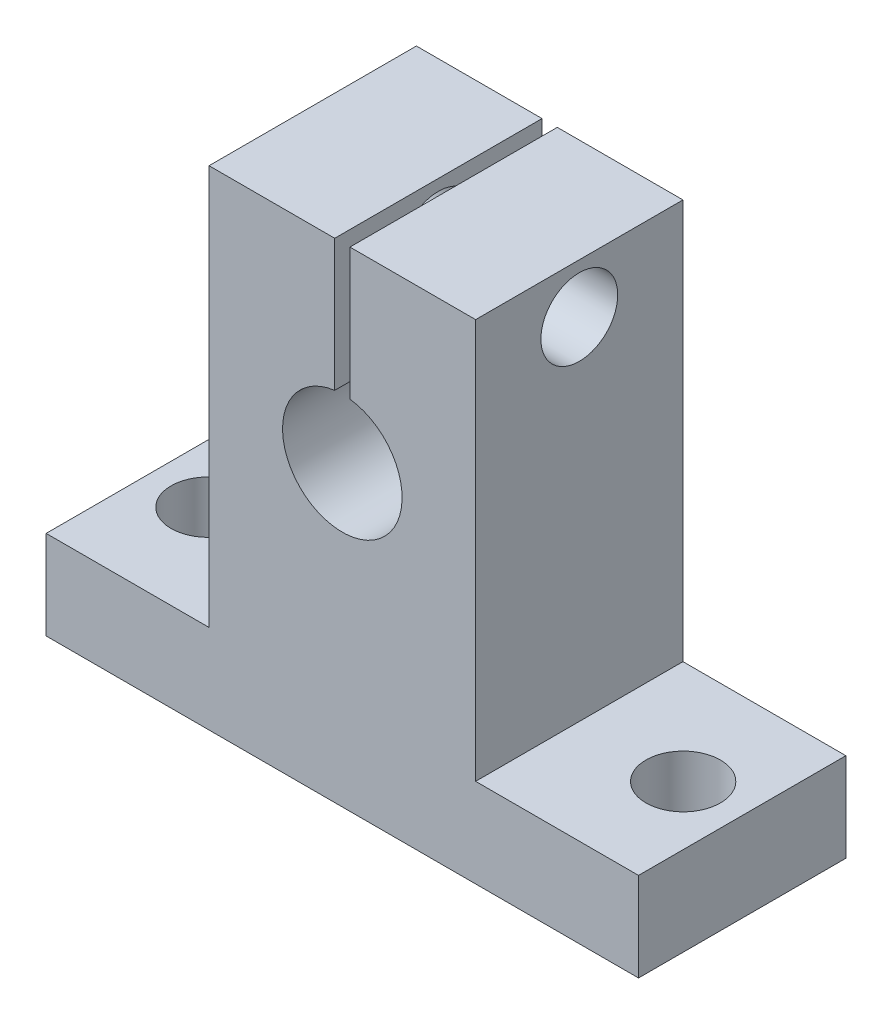
ISO-10303-21;
HEADER;
FILE_DESCRIPTION(('STEP AP214'),'2;1');
FILE_NAME('part.step','',(''),(''),'','','');
FILE_SCHEMA(('AUTOMOTIVE_DESIGN { 1 0 10303 214 1 1 1 1 }'));
ENDSEC;
DATA;
#1=APPLICATION_CONTEXT('core data for automotive mechanical design processes');
#2=APPLICATION_PROTOCOL_DEFINITION('international standard','automotive_design',2000,#1);
#3=PRODUCT_CONTEXT('',#1,'mechanical');
#4=PRODUCT('Part','Part','',(#3));
#5=PRODUCT_RELATED_PRODUCT_CATEGORY('part','',(#4));
#6=PRODUCT_DEFINITION_FORMATION('','',#4);
#7=PRODUCT_DEFINITION_CONTEXT('part definition',#1,'design');
#8=PRODUCT_DEFINITION('design','',#6,#7);
#9=PRODUCT_DEFINITION_SHAPE('','',#8);
#10=(LENGTH_UNIT() NAMED_UNIT(*) SI_UNIT(.MILLI.,.METRE.));
#11=(NAMED_UNIT(*) PLANE_ANGLE_UNIT() SI_UNIT($,.RADIAN.));
#12=(NAMED_UNIT(*) SI_UNIT($,.STERADIAN.) SOLID_ANGLE_UNIT());
#13=UNCERTAINTY_MEASURE_WITH_UNIT(LENGTH_MEASURE(1.E-05),#10,'distance_accuracy_value','');
#14=(GEOMETRIC_REPRESENTATION_CONTEXT(3) GLOBAL_UNCERTAINTY_ASSIGNED_CONTEXT((#13)) GLOBAL_UNIT_ASSIGNED_CONTEXT((#10,
#11,#12)) REPRESENTATION_CONTEXT('',''));
#15=CARTESIAN_POINT('',(0.,0.,0.));
#16=DIRECTION('',(0.,0.,1.));
#17=DIRECTION('',(1.,0.,0.));
#18=AXIS2_PLACEMENT_3D('',#15,#16,#17);
#19=CARTESIAN_POINT('',(-2.00038617608939,17.6991691104593,14.0000000000002));
#20=DIRECTION('',(0.,1.,0.));
#21=DIRECTION('',(0.,0.,1.));
#22=AXIS2_PLACEMENT_3D('',#19,#20,#21);
#23=PLANE('',#22);
#24=DIRECTION('',(0.,0.,-1.));
#25=VECTOR('',#24,1.);
#26=CARTESIAN_POINT('',(7.51407649357956,17.6991691104593,14.0000000000002));
#27=LINE('',#26,#25);
#28=CARTESIAN_POINT('',(7.51407649357956,17.6991691104593,14.0000000000002));
#29=VERTEX_POINT('',#28);
#30=CARTESIAN_POINT('',(7.51407649357935,17.6991691104593,0.));
#31=VERTEX_POINT('',#30);
#32=EDGE_CURVE('E221',#29,#31,#27,.T.);
#33=ORIENTED_EDGE('',*,*,#32,.F.);
#34=DIRECTION('',(1.,0.,0.));
#35=VECTOR('',#34,1.);
#36=CARTESIAN_POINT('',(-2.00038617608939,17.6991691104593,14.0000000000002));
#37=LINE('',#36,#35);
#38=CARTESIAN_POINT('',(15.9996138239114,17.6991691104593,14.0000000000002));
#39=VERTEX_POINT('',#38);
#40=EDGE_CURVE('E137',#29,#39,#37,.T.);
#41=ORIENTED_EDGE('',*,*,#40,.T.);
#42=DIRECTION('',(0.,0.,-1.));
#43=VECTOR('',#42,1.);
#44=CARTESIAN_POINT('',(15.9996138239114,17.6991691104593,14.0000000000002));
#45=LINE('',#44,#43);
#46=CARTESIAN_POINT('',(15.9996138239105,17.6991691104593,0.));
#47=VERTEX_POINT('',#46);
#48=EDGE_CURVE('E203',#39,#47,#45,.T.);
#49=ORIENTED_EDGE('',*,*,#48,.T.);
#50=DIRECTION('',(1.,0.,0.));
#51=VECTOR('',#50,1.);
#52=CARTESIAN_POINT('',(-2.0003861760894,17.6991691104593,0.));
#53=LINE('',#52,#51);
#54=EDGE_CURVE('E181',#31,#47,#53,.T.);
#55=ORIENTED_EDGE('',*,*,#54,.F.);
#56=EDGE_LOOP('',(#33,#41,#49,#55));
#57=FACE_BOUND('',#56,.T.);
#58=ADVANCED_FACE('F37',(#57),#23,.T.);
#59=CARTESIAN_POINT('',(26.9996138239105,-15.3008308895406,14.0000000000002));
#60=DIRECTION('',(-1.,0.,0.));
#61=DIRECTION('',(0.,0.,1.));
#62=AXIS2_PLACEMENT_3D('',#59,#60,#61);
#63=PLANE('',#62);
#64=DIRECTION('',(0.,1.,0.));
#65=VECTOR('',#64,1.);
#66=CARTESIAN_POINT('',(26.9996138239109,-15.3008308895406,0.));
#67=LINE('',#66,#65);
#68=CARTESIAN_POINT('',(26.9996138239109,-15.3008308895406,0.));
#69=VERTEX_POINT('',#68);
#70=CARTESIAN_POINT('',(26.9996138239113,-9.30083088954037,0.));
#71=VERTEX_POINT('',#70);
#72=EDGE_CURVE('E144',#69,#71,#67,.T.);
#73=ORIENTED_EDGE('',*,*,#72,.T.);
#74=DIRECTION('',(0.,0.,-1.));
#75=VECTOR('',#74,1.);
#76=CARTESIAN_POINT('',(26.9996138239113,-9.30083088954037,14.0000000000002));
#77=LINE('',#76,#75);
#78=CARTESIAN_POINT('',(26.9996138239113,-9.30083088954037,14.0000000000002));
#79=VERTEX_POINT('',#78);
#80=EDGE_CURVE('E208',#79,#71,#77,.T.);
#81=ORIENTED_EDGE('',*,*,#80,.F.);
#82=DIRECTION('',(0.,1.,0.));
#83=VECTOR('',#82,1.);
#84=CARTESIAN_POINT('',(26.9996138239105,-15.3008308895406,14.0000000000002));
#85=LINE('',#84,#83);
#86=CARTESIAN_POINT('',(26.9996138239105,-15.3008308895406,14.0000000000002));
#87=VERTEX_POINT('',#86);
#88=EDGE_CURVE('E153',#87,#79,#85,.T.);
#89=ORIENTED_EDGE('',*,*,#88,.F.);
#90=DIRECTION('',(0.,0.,-1.));
#91=VECTOR('',#90,1.);
#92=CARTESIAN_POINT('',(26.9996138239105,-15.3008308895406,14.0000000000002));
#93=LINE('',#92,#91);
#94=EDGE_CURVE('E210',#87,#69,#93,.T.);
#95=ORIENTED_EDGE('',*,*,#94,.T.);
#96=EDGE_LOOP('',(#73,#81,#89,#95));
#97=FACE_BOUND('',#96,.T.);
#98=ADVANCED_FACE('F39',(#97),#63,.F.);
#99=CARTESIAN_POINT('',(15.9996138239111,-9.30083088954037,14.0000000000002));
#100=DIRECTION('',(0.,1.,0.));
#101=DIRECTION('',(0.,0.,1.));
#102=AXIS2_PLACEMENT_3D('',#99,#100,#101);
#103=PLANE('',#102);
#104=CARTESIAN_POINT('',(23.0145157220571,-9.30083088954037,6.99999999999967));
#105=DIRECTION('',(0.,1.,0.));
#106=DIRECTION('',(0.,0.,1.));
#107=AXIS2_PLACEMENT_3D('',#104,#105,#106);
#108=CIRCLE('',#107,2.51486763293019);
#109=CARTESIAN_POINT('',(23.0145157220571,-9.30083088954034,9.51486763292987));
#110=VERTEX_POINT('',#109);
#111=EDGE_CURVE('E216',#110,#110,#108,.T.);
#112=ORIENTED_EDGE('',*,*,#111,.F.);
#113=EDGE_LOOP('',(#112));
#114=FACE_BOUND('',#113,.T.);
#115=DIRECTION('',(1.,0.,0.));
#116=VECTOR('',#115,1.);
#117=CARTESIAN_POINT('',(15.9996138239106,-9.30083088954037,0.));
#118=LINE('',#117,#116);
#119=CARTESIAN_POINT('',(15.9996138239106,-9.30083088954037,0.));
#120=VERTEX_POINT('',#119);
#121=EDGE_CURVE('E175',#120,#71,#118,.T.);
#122=ORIENTED_EDGE('',*,*,#121,.F.);
#123=DIRECTION('',(0.,0.,-1.));
#124=VECTOR('',#123,1.);
#125=CARTESIAN_POINT('',(15.9996138239111,-9.30083088954037,14.0000000000002));
#126=LINE('',#125,#124);
#127=CARTESIAN_POINT('',(15.9996138239111,-9.30083088954037,14.0000000000002));
#128=VERTEX_POINT('',#127);
#129=EDGE_CURVE('E206',#128,#120,#126,.T.);
#130=ORIENTED_EDGE('',*,*,#129,.F.);
#131=DIRECTION('',(1.,0.,0.));
#132=VECTOR('',#131,1.);
#133=CARTESIAN_POINT('',(15.9996138239111,-9.30083088954037,14.0000000000002));
#134=LINE('',#133,#132);
#135=EDGE_CURVE('E156',#128,#79,#134,.T.);
#136=ORIENTED_EDGE('',*,*,#135,.T.);
#137=ORIENTED_EDGE('',*,*,#80,.T.);
#138=EDGE_LOOP('',(#122,#130,#136,#137));
#139=FACE_BOUND('',#138,.T.);
#140=ADVANCED_FACE('F266',(#114,#139),#103,.T.);
#141=CARTESIAN_POINT('',(15.9996138239114,17.6991691104593,14.0000000000002));
#142=DIRECTION('',(1.,0.,0.));
#143=DIRECTION('',(0.,1.,0.));
#144=AXIS2_PLACEMENT_3D('',#141,#142,#143);
#145=PLANE('',#144);
#146=CARTESIAN_POINT('',(15.9996138239107,14.3512632276526,6.99999999999967));
#147=DIRECTION('',(1.,0.,0.));
#148=DIRECTION('',(0.,1.,0.));
#149=AXIS2_PLACEMENT_3D('',#146,#147,#148);
#150=CIRCLE('',#149,2.5939753446912);
#151=CARTESIAN_POINT('',(15.9996138239107,16.9452385723438,6.9999999999997));
#152=VERTEX_POINT('',#151);
#153=EDGE_CURVE('E138',#152,#152,#150,.T.);
#154=ORIENTED_EDGE('',*,*,#153,.F.);
#155=EDGE_LOOP('',(#154));
#156=FACE_BOUND('',#155,.T.);
#157=DIRECTION('',(0.,-1.,0.));
#158=VECTOR('',#157,1.);
#159=CARTESIAN_POINT('',(15.9996138239105,17.6991691104593,0.));
#160=LINE('',#159,#158);
#161=EDGE_CURVE('E178',#47,#120,#160,.T.);
#162=ORIENTED_EDGE('',*,*,#161,.F.);
#163=ORIENTED_EDGE('',*,*,#48,.F.);
#164=DIRECTION('',(0.,-1.,0.));
#165=VECTOR('',#164,1.);
#166=CARTESIAN_POINT('',(15.9996138239114,17.6991691104593,14.0000000000002));
#167=LINE('',#166,#165);
#168=EDGE_CURVE('E159',#39,#128,#167,.T.);
#169=ORIENTED_EDGE('',*,*,#168,.T.);
#170=ORIENTED_EDGE('',*,*,#129,.T.);
#171=EDGE_LOOP('',(#162,#163,#169,#170));
#172=FACE_BOUND('',#171,.T.);
#173=ADVANCED_FACE('F272',(#156,#172),#145,.T.);
#174=DIRECTION('',(0.,0.,1.));
#175=VECTOR('',#174,1.);
#176=CARTESIAN_POINT('',(6.48515115424205,17.6991691104593,14.0000000000002));
#177=LINE('',#176,#175);
#178=CARTESIAN_POINT('',(6.48515115424203,17.6991691104593,0.));
#179=VERTEX_POINT('',#178);
#180=CARTESIAN_POINT('',(6.48515115424205,17.6991691104593,14.0000000000002));
#181=VERTEX_POINT('',#180);
#182=EDGE_CURVE('E225',#179,#181,#177,.T.);
#183=ORIENTED_EDGE('',*,*,#182,.F.);
#184=CARTESIAN_POINT('',(-2.0003861760894,17.6991691104593,0.));
#185=VERTEX_POINT('',#184);
#186=EDGE_CURVE('E182',#185,#179,#53,.T.);
#187=ORIENTED_EDGE('',*,*,#186,.F.);
#188=DIRECTION('',(0.,0.,-1.));
#189=VECTOR('',#188,1.);
#190=CARTESIAN_POINT('',(-2.00038617608939,17.6991691104593,14.0000000000002));
#191=LINE('',#190,#189);
#192=CARTESIAN_POINT('',(-2.00038617608939,17.6991691104593,14.0000000000002));
#193=VERTEX_POINT('',#192);
#194=EDGE_CURVE('E201',#193,#185,#191,.T.);
#195=ORIENTED_EDGE('',*,*,#194,.F.);
#196=EDGE_CURVE('E162',#193,#181,#37,.T.);
#197=ORIENTED_EDGE('',*,*,#196,.T.);
#198=EDGE_LOOP('',(#183,#187,#195,#197));
#199=FACE_BOUND('',#198,.T.);
#200=ADVANCED_FACE('F262',(#199),#23,.T.);
#201=CARTESIAN_POINT('',(-2.00038617608939,17.6991691104593,14.0000000000002));
#202=DIRECTION('',(1.,0.,0.));
#203=DIRECTION('',(0.,1.,0.));
#204=AXIS2_PLACEMENT_3D('',#201,#202,#203);
#205=PLANE('',#204);
#206=CARTESIAN_POINT('',(-2.00038617608947,14.3512632276526,6.99999999999967));
#207=DIRECTION('',(-1.,0.,0.));
#208=DIRECTION('',(0.,-1.,0.));
#209=AXIS2_PLACEMENT_3D('',#206,#207,#208);
#210=CIRCLE('',#209,2.5939753446912);
#211=CARTESIAN_POINT('',(-2.00038617608948,11.7572878829614,6.99999999999965));
#212=VERTEX_POINT('',#211);
#213=EDGE_CURVE('E239',#212,#212,#210,.T.);
#214=ORIENTED_EDGE('',*,*,#213,.F.);
#215=EDGE_LOOP('',(#214));
#216=FACE_BOUND('',#215,.T.);
#217=DIRECTION('',(0.,-1.,0.));
#218=VECTOR('',#217,1.);
#219=CARTESIAN_POINT('',(-2.0003861760894,17.6991691104593,0.));
#220=LINE('',#219,#218);
#221=CARTESIAN_POINT('',(-2.00038617608943,-9.30083088954037,0.));
#222=VERTEX_POINT('',#221);
#223=EDGE_CURVE('E185',#185,#222,#220,.T.);
#224=ORIENTED_EDGE('',*,*,#223,.T.);
#225=DIRECTION('',(0.,0.,-1.));
#226=VECTOR('',#225,1.);
#227=CARTESIAN_POINT('',(-2.00038617608939,-9.30083088954037,14.0000000000002));
#228=LINE('',#227,#226);
#229=CARTESIAN_POINT('',(-2.00038617608939,-9.30083088954037,14.0000000000002));
#230=VERTEX_POINT('',#229);
#231=EDGE_CURVE('E198',#230,#222,#228,.T.);
#232=ORIENTED_EDGE('',*,*,#231,.F.);
#233=DIRECTION('',(0.,-1.,0.));
#234=VECTOR('',#233,1.);
#235=CARTESIAN_POINT('',(-2.00038617608939,17.6991691104593,14.0000000000002));
#236=LINE('',#235,#234);
#237=EDGE_CURVE('E165',#193,#230,#236,.T.);
#238=ORIENTED_EDGE('',*,*,#237,.F.);
#239=ORIENTED_EDGE('',*,*,#194,.T.);
#240=EDGE_LOOP('',(#224,#232,#238,#239));
#241=FACE_BOUND('',#240,.T.);
#242=ADVANCED_FACE('F271',(#216,#241),#205,.F.);
#243=CARTESIAN_POINT('',(-2.00038617608939,-9.30083088954037,14.0000000000002));
#244=DIRECTION('',(0.,-1.,0.));
#245=DIRECTION('',(0.,0.,-1.));
#246=AXIS2_PLACEMENT_3D('',#243,#244,#245);
#247=PLANE('',#246);
#248=CARTESIAN_POINT('',(-9.06576440971987,-9.30083088954037,6.99999999999967));
#249=DIRECTION('',(0.,1.,0.));
#250=DIRECTION('',(0.,0.,1.));
#251=AXIS2_PLACEMENT_3D('',#248,#249,#250);
#252=CIRCLE('',#251,2.49774965335652);
#253=CARTESIAN_POINT('',(-9.06576440971988,-9.30083088954034,9.49774965335619));
#254=VERTEX_POINT('',#253);
#255=EDGE_CURVE('E147',#254,#254,#252,.T.);
#256=ORIENTED_EDGE('',*,*,#255,.F.);
#257=EDGE_LOOP('',(#256));
#258=FACE_BOUND('',#257,.T.);
#259=DIRECTION('',(-1.,0.,0.));
#260=VECTOR('',#259,1.);
#261=CARTESIAN_POINT('',(-2.00038617608943,-9.30083088954037,0.));
#262=LINE('',#261,#260);
#263=CARTESIAN_POINT('',(-13.0003861760891,-9.30083088954037,0.));
#264=VERTEX_POINT('',#263);
#265=EDGE_CURVE('E187',#222,#264,#262,.T.);
#266=ORIENTED_EDGE('',*,*,#265,.T.);
#267=DIRECTION('',(0.,0.,-1.));
#268=VECTOR('',#267,1.);
#269=CARTESIAN_POINT('',(-13.0003861760893,-9.30083088954037,14.0000000000002));
#270=LINE('',#269,#268);
#271=CARTESIAN_POINT('',(-13.0003861760893,-9.30083088954037,14.0000000000002));
#272=VERTEX_POINT('',#271);
#273=EDGE_CURVE('E196',#272,#264,#270,.T.);
#274=ORIENTED_EDGE('',*,*,#273,.F.);
#275=DIRECTION('',(-1.,0.,0.));
#276=VECTOR('',#275,1.);
#277=CARTESIAN_POINT('',(-2.00038617608939,-9.30083088954037,14.0000000000002));
#278=LINE('',#277,#276);
#279=EDGE_CURVE('E167',#230,#272,#278,.T.);
#280=ORIENTED_EDGE('',*,*,#279,.F.);
#281=ORIENTED_EDGE('',*,*,#231,.T.);
#282=EDGE_LOOP('',(#266,#274,#280,#281));
#283=FACE_BOUND('',#282,.T.);
#284=ADVANCED_FACE('F278',(#258,#283),#247,.F.);
#285=CARTESIAN_POINT('',(-13.0003861760896,-15.3008308895406,14.0000000000002));
#286=DIRECTION('',(-1.,0.,0.));
#287=DIRECTION('',(0.,0.,1.));
#288=AXIS2_PLACEMENT_3D('',#285,#286,#287);
#289=PLANE('',#288);
#290=DIRECTION('',(0.,1.,0.));
#291=VECTOR('',#290,1.);
#292=CARTESIAN_POINT('',(-13.0003861760888,-15.3008308895406,0.));
#293=LINE('',#292,#291);
#294=CARTESIAN_POINT('',(-13.0003861760888,-15.3008308895406,0.));
#295=VERTEX_POINT('',#294);
#296=EDGE_CURVE('E190',#295,#264,#293,.T.);
#297=ORIENTED_EDGE('',*,*,#296,.F.);
#298=DIRECTION('',(0.,0.,-1.));
#299=VECTOR('',#298,1.);
#300=CARTESIAN_POINT('',(-13.0003861760896,-15.3008308895406,14.0000000000002));
#301=LINE('',#300,#299);
#302=CARTESIAN_POINT('',(-13.0003861760896,-15.3008308895406,14.0000000000002));
#303=VERTEX_POINT('',#302);
#304=EDGE_CURVE('E172',#303,#295,#301,.T.);
#305=ORIENTED_EDGE('',*,*,#304,.F.);
#306=DIRECTION('',(0.,1.,0.));
#307=VECTOR('',#306,1.);
#308=CARTESIAN_POINT('',(-13.0003861760896,-15.3008308895406,14.0000000000002));
#309=LINE('',#308,#307);
#310=EDGE_CURVE('E169',#303,#272,#309,.T.);
#311=ORIENTED_EDGE('',*,*,#310,.T.);
#312=ORIENTED_EDGE('',*,*,#273,.T.);
#313=EDGE_LOOP('',(#297,#305,#311,#312));
#314=FACE_BOUND('',#313,.T.);
#315=ADVANCED_FACE('F299',(#314),#289,.T.);
#316=CARTESIAN_POINT('',(-2.00038617608944,-15.3008308895406,14.0000000000002));
#317=DIRECTION('',(0.,-1.,0.));
#318=DIRECTION('',(1.,0.,0.));
#319=AXIS2_PLACEMENT_3D('',#316,#317,#318);
#320=PLANE('',#319);
#321=CARTESIAN_POINT('',(23.0145157220567,-15.3008308895406,6.99999999999967));
#322=DIRECTION('',(0.,-1.,0.));
#323=DIRECTION('',(1.,0.,0.));
#324=AXIS2_PLACEMENT_3D('',#321,#322,#323);
#325=CIRCLE('',#324,2.51486763293019);
#326=CARTESIAN_POINT('',(25.5293833549869,-15.3008308895406,6.99999999999967));
#327=VERTEX_POINT('',#326);
#328=EDGE_CURVE('E213',#327,#327,#325,.T.);
#329=ORIENTED_EDGE('',*,*,#328,.F.);
#330=EDGE_LOOP('',(#329));
#331=FACE_BOUND('',#330,.T.);
#332=CARTESIAN_POINT('',(-9.06576440971973,-15.3008308895406,6.99999999999967));
#333=DIRECTION('',(0.,-1.,0.));
#334=DIRECTION('',(1.,0.,0.));
#335=AXIS2_PLACEMENT_3D('',#332,#333,#334);
#336=CIRCLE('',#335,2.49774965335652);
#337=CARTESIAN_POINT('',(-6.56801475636322,-15.3008308895406,6.99999999999967));
#338=VERTEX_POINT('',#337);
#339=EDGE_CURVE('E142',#338,#338,#336,.T.);
#340=ORIENTED_EDGE('',*,*,#339,.F.);
#341=EDGE_LOOP('',(#340));
#342=FACE_BOUND('',#341,.T.);
#343=DIRECTION('',(-1.,0.,0.));
#344=VECTOR('',#343,1.);
#345=CARTESIAN_POINT('',(-2.00038617608922,-15.3008308895406,0.));
#346=LINE('',#345,#344);
#347=EDGE_CURVE('E154',#69,#295,#346,.T.);
#348=ORIENTED_EDGE('',*,*,#347,.F.);
#349=ORIENTED_EDGE('',*,*,#94,.F.);
#350=DIRECTION('',(1.,0.,0.));
#351=VECTOR('',#350,1.);
#352=CARTESIAN_POINT('',(-2.00038617608944,-15.3008308895406,14.0000000000002));
#353=LINE('',#352,#351);
#354=EDGE_CURVE('E151',#303,#87,#353,.T.);
#355=ORIENTED_EDGE('',*,*,#354,.F.);
#356=ORIENTED_EDGE('',*,*,#304,.T.);
#357=EDGE_LOOP('',(#348,#349,#355,#356));
#358=FACE_BOUND('',#357,.T.);
#359=ADVANCED_FACE('F301',(#331,#342,#358),#320,.T.);
#360=CARTESIAN_POINT('',(1.75207071073658E-13,0.,14.0000000000002));
#361=DIRECTION('',(0.,0.,1.));
#362=DIRECTION('',(1.,0.,0.));
#363=AXIS2_PLACEMENT_3D('',#360,#361,#362);
#364=PLANE('',#363);
#365=DIRECTION('',(0.,1.,0.));
#366=VECTOR('',#365,1.);
#367=CARTESIAN_POINT('',(7.51407649357922,18.6554074490735,14.0000000000002));
#368=LINE('',#367,#366);
#369=CARTESIAN_POINT('',(7.51407649357929,8.80582091431048,14.0000000000002));
#370=VERTEX_POINT('',#369);
#371=EDGE_CURVE('E125',#370,#29,#368,.T.);
#372=ORIENTED_EDGE('',*,*,#371,.F.);
#373=CARTESIAN_POINT('',(6.99961382391089,4.80309765097786,14.0000000000002));
#374=DIRECTION('',(0.,0.,1.));
#375=DIRECTION('',(1.,0.,0.));
#376=AXIS2_PLACEMENT_3D('',#373,#374,#375);
#377=CIRCLE('',#376,4.03564931099154);
#378=CARTESIAN_POINT('',(6.48515115424222,8.80582091431048,14.0000000000002));
#379=VERTEX_POINT('',#378);
#380=EDGE_CURVE('E135',#379,#370,#377,.T.);
#381=ORIENTED_EDGE('',*,*,#380,.F.);
#382=DIRECTION('',(0.,-1.,0.));
#383=VECTOR('',#382,1.);
#384=CARTESIAN_POINT('',(6.48515115424237,18.6554074490735,14.0000000000002));
#385=LINE('',#384,#383);
#386=EDGE_CURVE('E53',#181,#379,#385,.T.);
#387=ORIENTED_EDGE('',*,*,#386,.F.);
#388=ORIENTED_EDGE('',*,*,#196,.F.);
#389=ORIENTED_EDGE('',*,*,#237,.T.);
#390=ORIENTED_EDGE('',*,*,#279,.T.);
#391=ORIENTED_EDGE('',*,*,#310,.F.);
#392=ORIENTED_EDGE('',*,*,#354,.T.);
#393=ORIENTED_EDGE('',*,*,#88,.T.);
#394=ORIENTED_EDGE('',*,*,#135,.F.);
#395=ORIENTED_EDGE('',*,*,#168,.F.);
#396=ORIENTED_EDGE('',*,*,#40,.F.);
#397=EDGE_LOOP('',(#372,#381,#387,#388,#389,#390,#391,#392,#393,#394,#395,#396));
#398=FACE_BOUND('',#397,.T.);
#399=ADVANCED_FACE('F134',(#398),#364,.T.);
#400=CARTESIAN_POINT('',(0.,0.,0.));
#401=DIRECTION('',(0.,0.,1.));
#402=DIRECTION('',(1.,0.,0.));
#403=AXIS2_PLACEMENT_3D('',#400,#401,#402);
#404=PLANE('',#403);
#405=CARTESIAN_POINT('',(6.99961382391046,4.80309765097786,0.));
#406=DIRECTION('',(0.,0.,1.));
#407=DIRECTION('',(1.,0.,0.));
#408=AXIS2_PLACEMENT_3D('',#405,#406,#407);
#409=CIRCLE('',#408,4.03564931099154);
#410=CARTESIAN_POINT('',(6.48515115424219,8.80582091431048,0.));
#411=VERTEX_POINT('',#410);
#412=CARTESIAN_POINT('',(7.51407649357923,8.80582091431048,0.));
#413=VERTEX_POINT('',#412);
#414=EDGE_CURVE('E141',#411,#413,#409,.T.);
#415=ORIENTED_EDGE('',*,*,#414,.T.);
#416=DIRECTION('',(0.,1.,0.));
#417=VECTOR('',#416,1.);
#418=CARTESIAN_POINT('',(7.51407649357909,18.6554074490735,0.));
#419=LINE('',#418,#417);
#420=EDGE_CURVE('E61',#413,#31,#419,.T.);
#421=ORIENTED_EDGE('',*,*,#420,.T.);
#422=ORIENTED_EDGE('',*,*,#54,.T.);
#423=ORIENTED_EDGE('',*,*,#161,.T.);
#424=ORIENTED_EDGE('',*,*,#121,.T.);
#425=ORIENTED_EDGE('',*,*,#72,.F.);
#426=ORIENTED_EDGE('',*,*,#347,.T.);
#427=ORIENTED_EDGE('',*,*,#296,.T.);
#428=ORIENTED_EDGE('',*,*,#265,.F.);
#429=ORIENTED_EDGE('',*,*,#223,.F.);
#430=ORIENTED_EDGE('',*,*,#186,.T.);
#431=DIRECTION('',(0.,-1.,0.));
#432=VECTOR('',#431,1.);
#433=CARTESIAN_POINT('',(6.48515115424203,18.6554074490735,0.));
#434=LINE('',#433,#432);
#435=EDGE_CURVE('E229',#179,#411,#434,.T.);
#436=ORIENTED_EDGE('',*,*,#435,.T.);
#437=EDGE_LOOP('',(#415,#421,#422,#423,#424,#425,#426,#427,#428,#429,#430,#436));
#438=FACE_BOUND('',#437,.T.);
#439=ADVANCED_FACE('F286',(#438),#404,.F.);
#440=CARTESIAN_POINT('',(6.99961382391046,4.80309765097786,0.));
#441=DIRECTION('',(0.,0.,1.));
#442=DIRECTION('',(1.,0.,0.));
#443=AXIS2_PLACEMENT_3D('',#440,#441,#442);
#444=CYLINDRICAL_SURFACE('',#443,4.03564931099154);
#445=ORIENTED_EDGE('',*,*,#380,.T.);
#446=DIRECTION('',(0.,0.,1.));
#447=VECTOR('',#446,1.);
#448=CARTESIAN_POINT('',(7.51407649357923,8.80582091431048,0.));
#449=LINE('',#448,#447);
#450=EDGE_CURVE('E11',#370,#413,#449,.F.);
#451=ORIENTED_EDGE('',*,*,#450,.T.);
#452=ORIENTED_EDGE('',*,*,#414,.F.);
#453=DIRECTION('',(0.,0.,1.));
#454=VECTOR('',#453,1.);
#455=CARTESIAN_POINT('',(6.48515115424219,8.80582091431048,0.));
#456=LINE('',#455,#454);
#457=EDGE_CURVE('E46',#411,#379,#456,.T.);
#458=ORIENTED_EDGE('',*,*,#457,.T.);
#459=EDGE_LOOP('',(#445,#451,#452,#458));
#460=FACE_BOUND('',#459,.T.);
#461=ADVANCED_FACE('F140',(#460),#444,.F.);
#462=CARTESIAN_POINT('',(-9.06576440971977,-23.3008308895406,6.99999999999967));
#463=DIRECTION('',(0.,1.,0.));
#464=DIRECTION('',(0.,0.,1.));
#465=AXIS2_PLACEMENT_3D('',#462,#463,#464);
#466=CYLINDRICAL_SURFACE('',#465,2.49774965335652);
#467=ORIENTED_EDGE('',*,*,#339,.T.);
#468=EDGE_LOOP('',(#467));
#469=FACE_BOUND('',#468,.T.);
#470=ORIENTED_EDGE('',*,*,#255,.T.);
#471=EDGE_LOOP('',(#470));
#472=FACE_BOUND('',#471,.T.);
#473=ADVANCED_FACE('F385',(#469,#472),#466,.F.);
#474=CARTESIAN_POINT('',(23.0145157220563,-23.3008308895406,6.99999999999967));
#475=DIRECTION('',(0.,1.,0.));
#476=DIRECTION('',(0.,0.,1.));
#477=AXIS2_PLACEMENT_3D('',#474,#475,#476);
#478=CYLINDRICAL_SURFACE('',#477,2.51486763293019);
#479=ORIENTED_EDGE('',*,*,#328,.T.);
#480=EDGE_LOOP('',(#479));
#481=FACE_BOUND('',#480,.T.);
#482=ORIENTED_EDGE('',*,*,#111,.T.);
#483=EDGE_LOOP('',(#482));
#484=FACE_BOUND('',#483,.T.);
#485=ADVANCED_FACE('F394',(#481,#484),#478,.F.);
#486=CARTESIAN_POINT('',(6.48515115424203,18.6554074490735,0.));
#487=DIRECTION('',(-1.,0.,0.));
#488=DIRECTION('',(0.,0.,1.));
#489=AXIS2_PLACEMENT_3D('',#486,#487,#488);
#490=PLANE('',#489);
#491=CARTESIAN_POINT('',(6.48515115424224,14.3512632276526,6.99999999999967));
#492=DIRECTION('',(-1.,0.,0.));
#493=DIRECTION('',(0.,0.,1.));
#494=AXIS2_PLACEMENT_3D('',#491,#492,#493);
#495=CIRCLE('',#494,2.5939753446912);
#496=CARTESIAN_POINT('',(6.48515115424224,14.3512632276526,9.59397534469088));
#497=VERTEX_POINT('',#496);
#498=EDGE_CURVE('E236',#497,#497,#495,.T.);
#499=ORIENTED_EDGE('',*,*,#498,.T.);
#500=EDGE_LOOP('',(#499));
#501=FACE_BOUND('',#500,.T.);
#502=ORIENTED_EDGE('',*,*,#182,.T.);
#503=ORIENTED_EDGE('',*,*,#386,.T.);
#504=ORIENTED_EDGE('',*,*,#457,.F.);
#505=ORIENTED_EDGE('',*,*,#435,.F.);
#506=EDGE_LOOP('',(#502,#503,#504,#505));
#507=FACE_BOUND('',#506,.T.);
#508=ADVANCED_FACE('F256',(#501,#507),#490,.F.);
#509=CARTESIAN_POINT('',(7.51407649357909,18.6554074490735,0.));
#510=DIRECTION('',(1.,0.,0.));
#511=DIRECTION('',(0.,0.,-1.));
#512=AXIS2_PLACEMENT_3D('',#509,#510,#511);
#513=PLANE('',#512);
#514=CARTESIAN_POINT('',(7.51407649357948,14.3512632276526,6.99999999999967));
#515=DIRECTION('',(1.,0.,0.));
#516=DIRECTION('',(0.,0.,-1.));
#517=AXIS2_PLACEMENT_3D('',#514,#515,#516);
#518=CIRCLE('',#517,2.5939753446912);
#519=CARTESIAN_POINT('',(7.51407649357948,14.3512632276525,4.40602465530846));
#520=VERTEX_POINT('',#519);
#521=EDGE_CURVE('E41',#520,#520,#518,.T.);
#522=ORIENTED_EDGE('',*,*,#521,.T.);
#523=EDGE_LOOP('',(#522));
#524=FACE_BOUND('',#523,.T.);
#525=ORIENTED_EDGE('',*,*,#32,.T.);
#526=ORIENTED_EDGE('',*,*,#420,.F.);
#527=ORIENTED_EDGE('',*,*,#450,.F.);
#528=ORIENTED_EDGE('',*,*,#371,.T.);
#529=EDGE_LOOP('',(#525,#526,#527,#528));
#530=FACE_BOUND('',#529,.T.);
#531=ADVANCED_FACE('F124',(#524,#530),#513,.F.);
#532=CARTESIAN_POINT('',(26.9996138239109,14.3512632276526,6.99999999999967));
#533=DIRECTION('',(-1.,0.,0.));
#534=DIRECTION('',(0.,-1.,0.));
#535=AXIS2_PLACEMENT_3D('',#532,#533,#534);
#536=CYLINDRICAL_SURFACE('',#535,2.5939753446912);
#537=ORIENTED_EDGE('',*,*,#153,.T.);
#538=EDGE_LOOP('',(#537));
#539=FACE_BOUND('',#538,.T.);
#540=ORIENTED_EDGE('',*,*,#521,.F.);
#541=EDGE_LOOP('',(#540));
#542=FACE_BOUND('',#541,.T.);
#543=ADVANCED_FACE('F247',(#539,#542),#536,.F.);
#544=ORIENTED_EDGE('',*,*,#213,.T.);
#545=EDGE_LOOP('',(#544));
#546=FACE_BOUND('',#545,.T.);
#547=ORIENTED_EDGE('',*,*,#498,.F.);
#548=EDGE_LOOP('',(#547));
#549=FACE_BOUND('',#548,.T.);
#550=ADVANCED_FACE('F249',(#546,#549),#536,.F.);
#551=CLOSED_SHELL('',(#58,#98,#140,#173,#200,#242,#284,#315,#359,#399,#439,#461,#473,#485,#508,
#531,#543,#550));
#552=MANIFOLD_SOLID_BREP('B2',#551);
#553=ADVANCED_BREP_SHAPE_REPRESENTATION('',(#18,#552),#14);
#554=SHAPE_DEFINITION_REPRESENTATION(#9,#553);
ENDSEC;
END-ISO-10303-21;
